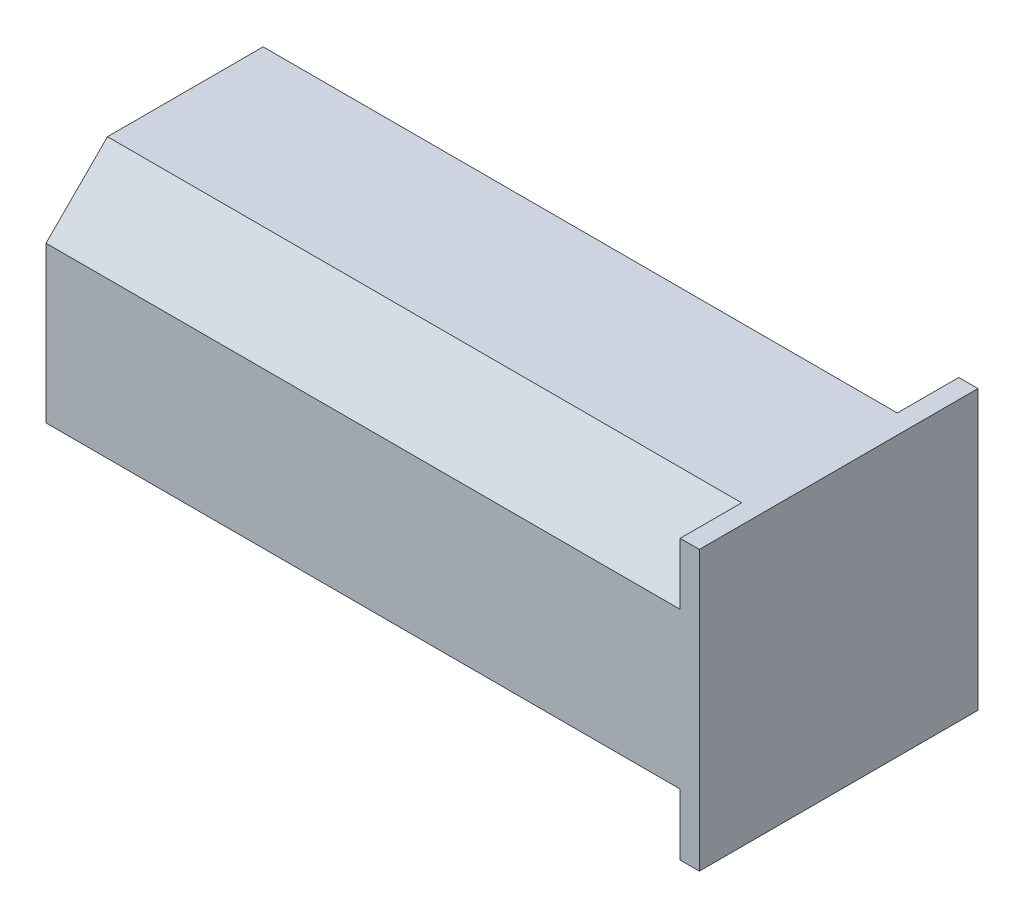
ISO-10303-21;
HEADER;
FILE_DESCRIPTION(('STEP AP214'),'2;1');
FILE_NAME('part.step','',(''),(''),'','','');
FILE_SCHEMA(('AUTOMOTIVE_DESIGN { 1 0 10303 214 1 1 1 1 }'));
ENDSEC;
DATA;
#1=APPLICATION_CONTEXT('core data for automotive mechanical design processes');
#2=APPLICATION_PROTOCOL_DEFINITION('international standard','automotive_design',2000,#1);
#3=PRODUCT_CONTEXT('',#1,'mechanical');
#4=PRODUCT('Part','Part','',(#3));
#5=PRODUCT_RELATED_PRODUCT_CATEGORY('part','',(#4));
#6=PRODUCT_DEFINITION_FORMATION('','',#4);
#7=PRODUCT_DEFINITION_CONTEXT('part definition',#1,'design');
#8=PRODUCT_DEFINITION('design','',#6,#7);
#9=PRODUCT_DEFINITION_SHAPE('','',#8);
#10=(LENGTH_UNIT() NAMED_UNIT(*) SI_UNIT(.MILLI.,.METRE.));
#11=(NAMED_UNIT(*) PLANE_ANGLE_UNIT() SI_UNIT($,.RADIAN.));
#12=(NAMED_UNIT(*) SI_UNIT($,.STERADIAN.) SOLID_ANGLE_UNIT());
#13=UNCERTAINTY_MEASURE_WITH_UNIT(LENGTH_MEASURE(1.E-05),#10,'distance_accuracy_value','');
#14=(GEOMETRIC_REPRESENTATION_CONTEXT(3) GLOBAL_UNCERTAINTY_ASSIGNED_CONTEXT((#13)) GLOBAL_UNIT_ASSIGNED_CONTEXT((#10,
#11,#12)) REPRESENTATION_CONTEXT('',''));
#15=CARTESIAN_POINT('',(0.,0.,0.));
#16=DIRECTION('',(0.,0.,1.));
#17=DIRECTION('',(1.,0.,0.));
#18=AXIS2_PLACEMENT_3D('',#15,#16,#17);
#19=CARTESIAN_POINT('',(103.000000000006,0.128148106527007,1448.82663753752));
#20=DIRECTION('',(0.,0.,1.));
#21=DIRECTION('',(1.,0.,0.));
#22=AXIS2_PLACEMENT_3D('',#19,#20,#21);
#23=PLANE('',#22);
#24=DIRECTION('',(1.,0.,0.));
#25=VECTOR('',#24,1.);
#26=CARTESIAN_POINT('',(111.000000000006,-36.121851893473,1448.82663753752));
#27=LINE('',#26,#25);
#28=CARTESIAN_POINT('',(103.000000000006,-36.121851893473,1448.82663753752));
#29=VERTEX_POINT('',#28);
#30=CARTESIAN_POINT('',(108.000000000006,-36.121851893473,1448.82663753752));
#31=VERTEX_POINT('',#30);
#32=EDGE_CURVE('E111',#29,#31,#27,.T.);
#33=ORIENTED_EDGE('',*,*,#32,.T.);
#34=DIRECTION('',(0.,1.,0.));
#35=VECTOR('',#34,1.);
#36=CARTESIAN_POINT('',(108.000000000006,0.128148106527007,1448.82663753752));
#37=LINE('',#36,#35);
#38=CARTESIAN_POINT('',(108.000000000006,36.378148106527,1448.82663753752));
#39=VERTEX_POINT('',#38);
#40=EDGE_CURVE('E102',#31,#39,#37,.T.);
#41=ORIENTED_EDGE('',*,*,#40,.T.);
#42=DIRECTION('',(1.,0.,0.));
#43=VECTOR('',#42,1.);
#44=CARTESIAN_POINT('',(111.000000000006,36.378148106527,1448.82663753752));
#45=LINE('',#44,#43);
#46=CARTESIAN_POINT('',(103.000000000006,36.378148106527,1448.82663753752));
#47=VERTEX_POINT('',#46);
#48=EDGE_CURVE('E20',#47,#39,#45,.T.);
#49=ORIENTED_EDGE('',*,*,#48,.F.);
#50=DIRECTION('',(0.,-1.,0.));
#51=VECTOR('',#50,1.);
#52=CARTESIAN_POINT('',(103.000000000006,36.378148106527,1448.82663753752));
#53=LINE('',#52,#51);
#54=CARTESIAN_POINT('',(103.000000000006,20.378148106527,1448.82663753752));
#55=VERTEX_POINT('',#54);
#56=EDGE_CURVE('E110',#47,#55,#53,.T.);
#57=ORIENTED_EDGE('',*,*,#56,.T.);
#58=DIRECTION('',(-1.,0.,0.));
#59=VECTOR('',#58,1.);
#60=CARTESIAN_POINT('',(103.000000000006,20.378148106527,1448.82663753752));
#61=LINE('',#60,#59);
#62=CARTESIAN_POINT('',(-61.9999999999935,20.378148106527,1448.82663753752));
#63=VERTEX_POINT('',#62);
#64=EDGE_CURVE('E171',#55,#63,#61,.T.);
#65=ORIENTED_EDGE('',*,*,#64,.T.);
#66=DIRECTION('',(0.,-1.,0.));
#67=VECTOR('',#66,1.);
#68=CARTESIAN_POINT('',(-61.9999999999935,0.128148106527027,1448.82663753752));
#69=LINE('',#68,#67);
#70=CARTESIAN_POINT('',(-61.9999999999935,-20.121851893473,1448.82663753752));
#71=VERTEX_POINT('',#70);
#72=EDGE_CURVE('E168',#63,#71,#69,.T.);
#73=ORIENTED_EDGE('',*,*,#72,.T.);
#74=DIRECTION('',(1.,0.,0.));
#75=VECTOR('',#74,1.);
#76=CARTESIAN_POINT('',(103.000000000006,-20.121851893473,1448.82663753752));
#77=LINE('',#76,#75);
#78=CARTESIAN_POINT('',(103.000000000006,-20.121851893473,1448.82663753752));
#79=VERTEX_POINT('',#78);
#80=EDGE_CURVE('E170',#71,#79,#77,.T.);
#81=ORIENTED_EDGE('',*,*,#80,.T.);
#82=EDGE_CURVE('E115',#79,#29,#53,.T.);
#83=ORIENTED_EDGE('',*,*,#82,.T.);
#84=EDGE_LOOP('',(#33,#41,#49,#57,#65,#73,#81,#83));
#85=FACE_BOUND('',#84,.T.);
#86=ADVANCED_FACE('F16',(#85),#23,.T.);
#87=CARTESIAN_POINT('',(103.000000000006,-36.121851893473,1412.57663753752));
#88=DIRECTION('',(0.,-1.,0.));
#89=DIRECTION('',(-1.,0.,0.));
#90=AXIS2_PLACEMENT_3D('',#87,#88,#89);
#91=PLANE('',#90);
#92=DIRECTION('',(1.,0.,0.));
#93=VECTOR('',#92,1.);
#94=CARTESIAN_POINT('',(111.000000000006,-36.121851893473,1376.32663753752));
#95=LINE('',#94,#93);
#96=CARTESIAN_POINT('',(103.000000000006,-36.121851893473,1376.32663753752));
#97=VERTEX_POINT('',#96);
#98=CARTESIAN_POINT('',(108.000000000006,-36.121851893473,1376.32663753752));
#99=VERTEX_POINT('',#98);
#100=EDGE_CURVE('E122',#97,#99,#95,.T.);
#101=ORIENTED_EDGE('',*,*,#100,.T.);
#102=DIRECTION('',(0.,0.,1.));
#103=VECTOR('',#102,1.);
#104=CARTESIAN_POINT('',(108.000000000006,-36.121851893473,1412.57663753752));
#105=LINE('',#104,#103);
#106=EDGE_CURVE('E105',#99,#31,#105,.T.);
#107=ORIENTED_EDGE('',*,*,#106,.T.);
#108=ORIENTED_EDGE('',*,*,#32,.F.);
#109=DIRECTION('',(0.,0.,1.));
#110=VECTOR('',#109,1.);
#111=CARTESIAN_POINT('',(103.000000000006,-36.121851893473,1376.32663753752));
#112=LINE('',#111,#110);
#113=CARTESIAN_POINT('',(103.000000000006,-36.121851893473,1432.82663753752));
#114=VERTEX_POINT('',#113);
#115=EDGE_CURVE('E198',#114,#29,#112,.T.);
#116=ORIENTED_EDGE('',*,*,#115,.F.);
#117=DIRECTION('',(-1.,0.,0.));
#118=VECTOR('',#117,1.);
#119=CARTESIAN_POINT('',(103.000000000006,-36.121851893473,1432.82663753752));
#120=LINE('',#119,#118);
#121=CARTESIAN_POINT('',(-61.9999999999935,-36.121851893473,1432.82663753752));
#122=VERTEX_POINT('',#121);
#123=EDGE_CURVE('E123',#114,#122,#120,.T.);
#124=ORIENTED_EDGE('',*,*,#123,.T.);
#125=DIRECTION('',(0.,0.,-1.));
#126=VECTOR('',#125,1.);
#127=CARTESIAN_POINT('',(-61.9999999999935,-36.121851893473,1412.57663753752));
#128=LINE('',#127,#126);
#129=CARTESIAN_POINT('',(-61.9999999999935,-36.121851893473,1392.32663753752));
#130=VERTEX_POINT('',#129);
#131=EDGE_CURVE('E126',#122,#130,#128,.T.);
#132=ORIENTED_EDGE('',*,*,#131,.T.);
#133=DIRECTION('',(1.,0.,0.));
#134=VECTOR('',#133,1.);
#135=CARTESIAN_POINT('',(103.000000000006,-36.121851893473,1392.32663753752));
#136=LINE('',#135,#134);
#137=CARTESIAN_POINT('',(103.000000000006,-36.121851893473,1392.32663753752));
#138=VERTEX_POINT('',#137);
#139=EDGE_CURVE('E134',#130,#138,#136,.T.);
#140=ORIENTED_EDGE('',*,*,#139,.T.);
#141=EDGE_CURVE('E150',#97,#138,#112,.T.);
#142=ORIENTED_EDGE('',*,*,#141,.F.);
#143=EDGE_LOOP('',(#101,#107,#108,#116,#124,#132,#140,#142));
#144=FACE_BOUND('',#143,.T.);
#145=ADVANCED_FACE('F119',(#144),#91,.T.);
#146=CARTESIAN_POINT('',(103.000000000006,0.128148106527011,1376.32663753752));
#147=DIRECTION('',(0.,0.,-1.));
#148=DIRECTION('',(-1.,0.,0.));
#149=AXIS2_PLACEMENT_3D('',#146,#147,#148);
#150=PLANE('',#149);
#151=DIRECTION('',(1.,0.,0.));
#152=VECTOR('',#151,1.);
#153=CARTESIAN_POINT('',(111.000000000006,36.378148106527,1376.32663753752));
#154=LINE('',#153,#152);
#155=CARTESIAN_POINT('',(103.000000000006,36.378148106527,1376.32663753752));
#156=VERTEX_POINT('',#155);
#157=CARTESIAN_POINT('',(108.000000000006,36.378148106527,1376.32663753752));
#158=VERTEX_POINT('',#157);
#159=EDGE_CURVE('E133',#156,#158,#154,.T.);
#160=ORIENTED_EDGE('',*,*,#159,.T.);
#161=DIRECTION('',(0.,-1.,0.));
#162=VECTOR('',#161,1.);
#163=CARTESIAN_POINT('',(108.000000000006,0.128148106527011,1376.32663753752));
#164=LINE('',#163,#162);
#165=EDGE_CURVE('E39',#158,#99,#164,.T.);
#166=ORIENTED_EDGE('',*,*,#165,.T.);
#167=ORIENTED_EDGE('',*,*,#100,.F.);
#168=DIRECTION('',(0.,-1.,0.));
#169=VECTOR('',#168,1.);
#170=CARTESIAN_POINT('',(103.000000000006,36.378148106527,1376.32663753752));
#171=LINE('',#170,#169);
#172=CARTESIAN_POINT('',(103.000000000006,-20.121851893473,1376.32663753752));
#173=VERTEX_POINT('',#172);
#174=EDGE_CURVE('E11',#173,#97,#171,.T.);
#175=ORIENTED_EDGE('',*,*,#174,.F.);
#176=DIRECTION('',(-1.,0.,0.));
#177=VECTOR('',#176,1.);
#178=CARTESIAN_POINT('',(103.000000000006,-20.121851893473,1376.32663753752));
#179=LINE('',#178,#177);
#180=CARTESIAN_POINT('',(-61.9999999999935,-20.1218518934729,1376.32663753752));
#181=VERTEX_POINT('',#180);
#182=EDGE_CURVE('E132',#173,#181,#179,.T.);
#183=ORIENTED_EDGE('',*,*,#182,.T.);
#184=DIRECTION('',(0.,1.,0.));
#185=VECTOR('',#184,1.);
#186=CARTESIAN_POINT('',(-61.9999999999935,0.128148106527032,1376.32663753752));
#187=LINE('',#186,#185);
#188=CARTESIAN_POINT('',(-61.9999999999935,20.378148106527,1376.32663753752));
#189=VERTEX_POINT('',#188);
#190=EDGE_CURVE('E173',#181,#189,#187,.T.);
#191=ORIENTED_EDGE('',*,*,#190,.T.);
#192=DIRECTION('',(1.,0.,0.));
#193=VECTOR('',#192,1.);
#194=CARTESIAN_POINT('',(103.000000000006,20.378148106527,1376.32663753752));
#195=LINE('',#194,#193);
#196=CARTESIAN_POINT('',(103.000000000006,20.378148106527,1376.32663753752));
#197=VERTEX_POINT('',#196);
#198=EDGE_CURVE('E176',#189,#197,#195,.T.);
#199=ORIENTED_EDGE('',*,*,#198,.T.);
#200=EDGE_CURVE('E164',#156,#197,#171,.T.);
#201=ORIENTED_EDGE('',*,*,#200,.F.);
#202=EDGE_LOOP('',(#160,#166,#167,#175,#183,#191,#199,#201));
#203=FACE_BOUND('',#202,.T.);
#204=ADVANCED_FACE('F250',(#203),#150,.T.);
#205=CARTESIAN_POINT('',(103.000000000006,36.378148106527,1412.57663753752));
#206=DIRECTION('',(0.,1.,0.));
#207=DIRECTION('',(1.,0.,0.));
#208=AXIS2_PLACEMENT_3D('',#205,#206,#207);
#209=PLANE('',#208);
#210=ORIENTED_EDGE('',*,*,#48,.T.);
#211=DIRECTION('',(0.,0.,-1.));
#212=VECTOR('',#211,1.);
#213=CARTESIAN_POINT('',(108.000000000006,36.378148106527,1412.57663753752));
#214=LINE('',#213,#212);
#215=EDGE_CURVE('E33',#39,#158,#214,.T.);
#216=ORIENTED_EDGE('',*,*,#215,.T.);
#217=ORIENTED_EDGE('',*,*,#159,.F.);
#218=DIRECTION('',(0.,0.,1.));
#219=VECTOR('',#218,1.);
#220=CARTESIAN_POINT('',(103.000000000006,36.378148106527,1376.32663753752));
#221=LINE('',#220,#219);
#222=CARTESIAN_POINT('',(103.000000000006,36.378148106527,1392.32663753752));
#223=VERTEX_POINT('',#222);
#224=EDGE_CURVE('E184',#156,#223,#221,.T.);
#225=ORIENTED_EDGE('',*,*,#224,.T.);
#226=DIRECTION('',(-1.,0.,0.));
#227=VECTOR('',#226,1.);
#228=CARTESIAN_POINT('',(103.000000000006,36.378148106527,1392.32663753752));
#229=LINE('',#228,#227);
#230=CARTESIAN_POINT('',(-61.9999999999935,36.378148106527,1392.32663753752));
#231=VERTEX_POINT('',#230);
#232=EDGE_CURVE('E181',#223,#231,#229,.T.);
#233=ORIENTED_EDGE('',*,*,#232,.T.);
#234=DIRECTION('',(0.,0.,1.));
#235=VECTOR('',#234,1.);
#236=CARTESIAN_POINT('',(-61.9999999999935,36.378148106527,1412.57663753752));
#237=LINE('',#236,#235);
#238=CARTESIAN_POINT('',(-61.9999999999935,36.378148106527,1432.82663753752));
#239=VERTEX_POINT('',#238);
#240=EDGE_CURVE('E177',#231,#239,#237,.T.);
#241=ORIENTED_EDGE('',*,*,#240,.T.);
#242=DIRECTION('',(1.,0.,0.));
#243=VECTOR('',#242,1.);
#244=CARTESIAN_POINT('',(103.000000000006,36.378148106527,1432.82663753752));
#245=LINE('',#244,#243);
#246=CARTESIAN_POINT('',(103.000000000006,36.378148106527,1432.82663753752));
#247=VERTEX_POINT('',#246);
#248=EDGE_CURVE('E180',#239,#247,#245,.T.);
#249=ORIENTED_EDGE('',*,*,#248,.T.);
#250=EDGE_CURVE('E161',#247,#47,#221,.T.);
#251=ORIENTED_EDGE('',*,*,#250,.T.);
#252=EDGE_LOOP('',(#210,#216,#217,#225,#233,#241,#249,#251));
#253=FACE_BOUND('',#252,.T.);
#254=ADVANCED_FACE('F273',(#253),#209,.T.);
#255=CARTESIAN_POINT('',(-61.9999999999935,0.128148106527029,1412.57663753752));
#256=DIRECTION('',(-1.,0.,0.));
#257=DIRECTION('',(0.,1.,0.));
#258=AXIS2_PLACEMENT_3D('',#255,#256,#257);
#259=PLANE('',#258);
#260=ORIENTED_EDGE('',*,*,#240,.F.);
#261=DIRECTION('',(0.,0.707106781186547,0.707106781186548));
#262=VECTOR('',#261,1.);
#263=CARTESIAN_POINT('',(-61.9999999999935,28.378148106527,1384.32663753752));
#264=LINE('',#263,#262);
#265=EDGE_CURVE('E158',#231,#189,#264,.F.);
#266=ORIENTED_EDGE('',*,*,#265,.T.);
#267=ORIENTED_EDGE('',*,*,#190,.F.);
#268=DIRECTION('',(0.,0.707106781186547,-0.707106781186548));
#269=VECTOR('',#268,1.);
#270=CARTESIAN_POINT('',(-61.9999999999935,-28.1218518934729,1384.32663753752));
#271=LINE('',#270,#269);
#272=EDGE_CURVE('E160',#181,#130,#271,.F.);
#273=ORIENTED_EDGE('',*,*,#272,.T.);
#274=ORIENTED_EDGE('',*,*,#131,.F.);
#275=DIRECTION('',(0.,-0.707106781186547,-0.707106781186548));
#276=VECTOR('',#275,1.);
#277=CARTESIAN_POINT('',(-61.9999999999935,-28.121851893473,1440.82663753752));
#278=LINE('',#277,#276);
#279=EDGE_CURVE('E165',#122,#71,#278,.F.);
#280=ORIENTED_EDGE('',*,*,#279,.T.);
#281=ORIENTED_EDGE('',*,*,#72,.F.);
#282=DIRECTION('',(0.,-0.707106781186547,0.707106781186548));
#283=VECTOR('',#282,1.);
#284=CARTESIAN_POINT('',(-61.9999999999935,28.378148106527,1440.82663753752));
#285=LINE('',#284,#283);
#286=EDGE_CURVE('E162',#63,#239,#285,.F.);
#287=ORIENTED_EDGE('',*,*,#286,.T.);
#288=EDGE_LOOP('',(#260,#266,#267,#273,#274,#280,#281,#287));
#289=FACE_BOUND('',#288,.T.);
#290=ADVANCED_FACE('F243',(#289),#259,.T.);
#291=CARTESIAN_POINT('',(103.000000000006,36.378148106527,1392.32663753752));
#292=DIRECTION('',(0.,-0.707106781186548,0.707106781186547));
#293=DIRECTION('',(0.,-0.707106781186547,-0.707106781186548));
#294=AXIS2_PLACEMENT_3D('',#291,#292,#293);
#295=PLANE('',#294);
#296=DIRECTION('',(0.,-0.707106781186547,-0.707106781186548));
#297=VECTOR('',#296,1.);
#298=CARTESIAN_POINT('',(103.000000000006,28.378148106527,1384.32663753752));
#299=LINE('',#298,#297);
#300=EDGE_CURVE('E216',#197,#223,#299,.F.);
#301=ORIENTED_EDGE('',*,*,#300,.F.);
#302=ORIENTED_EDGE('',*,*,#198,.F.);
#303=ORIENTED_EDGE('',*,*,#265,.F.);
#304=ORIENTED_EDGE('',*,*,#232,.F.);
#305=EDGE_LOOP('',(#301,#302,#303,#304));
#306=FACE_BOUND('',#305,.T.);
#307=ADVANCED_FACE('F278',(#306),#295,.F.);
#308=CARTESIAN_POINT('',(103.000000000006,20.378148106527,1448.82663753752));
#309=DIRECTION('',(0.,-0.707106781186548,-0.707106781186547));
#310=DIRECTION('',(0.,0.707106781186547,-0.707106781186548));
#311=AXIS2_PLACEMENT_3D('',#308,#309,#310);
#312=PLANE('',#311);
#313=DIRECTION('',(0.,0.707106781186547,-0.707106781186548));
#314=VECTOR('',#313,1.);
#315=CARTESIAN_POINT('',(103.000000000006,28.378148106527,1440.82663753752));
#316=LINE('',#315,#314);
#317=EDGE_CURVE('E220',#247,#55,#316,.F.);
#318=ORIENTED_EDGE('',*,*,#317,.F.);
#319=ORIENTED_EDGE('',*,*,#248,.F.);
#320=ORIENTED_EDGE('',*,*,#286,.F.);
#321=ORIENTED_EDGE('',*,*,#64,.F.);
#322=EDGE_LOOP('',(#318,#319,#320,#321));
#323=FACE_BOUND('',#322,.T.);
#324=ADVANCED_FACE('F283',(#323),#312,.F.);
#325=CARTESIAN_POINT('',(103.000000000006,-36.121851893473,1432.82663753752));
#326=DIRECTION('',(0.,0.707106781186548,-0.707106781186547));
#327=DIRECTION('',(0.,0.707106781186547,0.707106781186548));
#328=AXIS2_PLACEMENT_3D('',#325,#326,#327);
#329=PLANE('',#328);
#330=DIRECTION('',(0.,0.707106781186547,0.707106781186548));
#331=VECTOR('',#330,1.);
#332=CARTESIAN_POINT('',(103.000000000006,-28.121851893473,1440.82663753752));
#333=LINE('',#332,#331);
#334=EDGE_CURVE('E200',#79,#114,#333,.F.);
#335=ORIENTED_EDGE('',*,*,#334,.F.);
#336=ORIENTED_EDGE('',*,*,#80,.F.);
#337=ORIENTED_EDGE('',*,*,#279,.F.);
#338=ORIENTED_EDGE('',*,*,#123,.F.);
#339=EDGE_LOOP('',(#335,#336,#337,#338));
#340=FACE_BOUND('',#339,.T.);
#341=ADVANCED_FACE('F289',(#340),#329,.F.);
#342=CARTESIAN_POINT('',(103.000000000006,-20.121851893473,1376.32663753752));
#343=DIRECTION('',(0.,0.707106781186548,0.707106781186547));
#344=DIRECTION('',(0.,-0.707106781186547,0.707106781186548));
#345=AXIS2_PLACEMENT_3D('',#342,#343,#344);
#346=PLANE('',#345);
#347=DIRECTION('',(0.,-0.707106781186547,0.707106781186548));
#348=VECTOR('',#347,1.);
#349=CARTESIAN_POINT('',(103.000000000006,-28.121851893473,1384.32663753752));
#350=LINE('',#349,#348);
#351=EDGE_CURVE('E25',#138,#173,#350,.F.);
#352=ORIENTED_EDGE('',*,*,#351,.F.);
#353=ORIENTED_EDGE('',*,*,#139,.F.);
#354=ORIENTED_EDGE('',*,*,#272,.F.);
#355=ORIENTED_EDGE('',*,*,#182,.F.);
#356=EDGE_LOOP('',(#352,#353,#354,#355));
#357=FACE_BOUND('',#356,.T.);
#358=ADVANCED_FACE('F248',(#357),#346,.F.);
#359=CARTESIAN_POINT('',(103.000000000006,36.378148106527,1448.82663753752));
#360=DIRECTION('',(-1.,0.,0.));
#361=DIRECTION('',(0.,-1.,0.));
#362=AXIS2_PLACEMENT_3D('',#359,#360,#361);
#363=PLANE('',#362);
#364=ORIENTED_EDGE('',*,*,#200,.T.);
#365=ORIENTED_EDGE('',*,*,#300,.T.);
#366=ORIENTED_EDGE('',*,*,#224,.F.);
#367=EDGE_LOOP('',(#364,#365,#366));
#368=FACE_BOUND('',#367,.T.);
#369=ADVANCED_FACE('F255',(#368),#363,.T.);
#370=ORIENTED_EDGE('',*,*,#250,.F.);
#371=ORIENTED_EDGE('',*,*,#317,.T.);
#372=ORIENTED_EDGE('',*,*,#56,.F.);
#373=EDGE_LOOP('',(#370,#371,#372));
#374=FACE_BOUND('',#373,.T.);
#375=ADVANCED_FACE('F261',(#374),#363,.T.);
#376=ORIENTED_EDGE('',*,*,#82,.F.);
#377=ORIENTED_EDGE('',*,*,#334,.T.);
#378=ORIENTED_EDGE('',*,*,#115,.T.);
#379=EDGE_LOOP('',(#376,#377,#378));
#380=FACE_BOUND('',#379,.T.);
#381=ADVANCED_FACE('F237',(#380),#363,.T.);
#382=ORIENTED_EDGE('',*,*,#141,.T.);
#383=ORIENTED_EDGE('',*,*,#351,.T.);
#384=ORIENTED_EDGE('',*,*,#174,.T.);
#385=EDGE_LOOP('',(#382,#383,#384));
#386=FACE_BOUND('',#385,.T.);
#387=ADVANCED_FACE('F252',(#386),#363,.T.);
#388=CARTESIAN_POINT('',(108.000000000006,0.128148106527,1412.57663753752));
#389=DIRECTION('',(1.,0.,0.));
#390=DIRECTION('',(0.,0.,-1.));
#391=AXIS2_PLACEMENT_3D('',#388,#389,#390);
#392=PLANE('',#391);
#393=ORIENTED_EDGE('',*,*,#40,.F.);
#394=ORIENTED_EDGE('',*,*,#106,.F.);
#395=ORIENTED_EDGE('',*,*,#165,.F.);
#396=ORIENTED_EDGE('',*,*,#215,.F.);
#397=EDGE_LOOP('',(#393,#394,#395,#396));
#398=FACE_BOUND('',#397,.T.);
#399=ADVANCED_FACE('F18',(#398),#392,.T.);
#400=CLOSED_SHELL('',(#86,#145,#204,#254,#290,#307,#324,#341,#358,#369,#375,#381,#387,#399));
#401=MANIFOLD_SOLID_BREP('B1',#400);
#402=ADVANCED_BREP_SHAPE_REPRESENTATION('',(#18,#401),#14);
#403=SHAPE_DEFINITION_REPRESENTATION(#9,#402);
ENDSEC;
END-ISO-10303-21;
